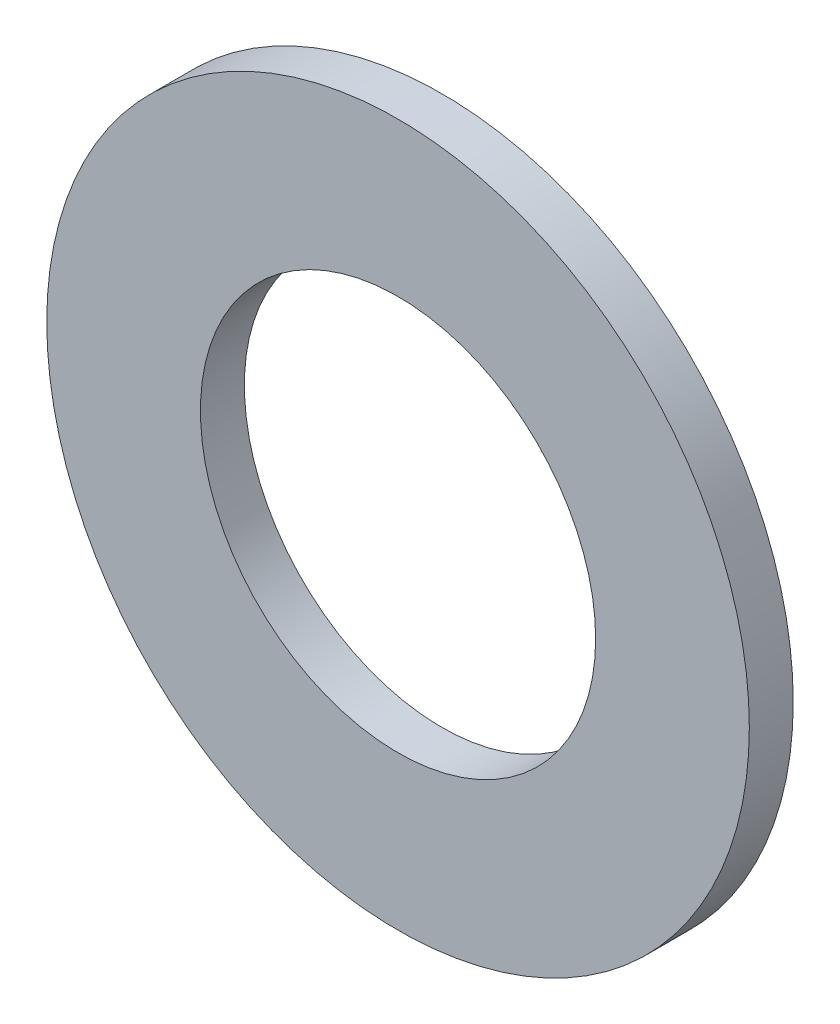
ISO-10303-21;
HEADER;
FILE_DESCRIPTION(('STEP AP214'),'2;1');
FILE_NAME('part.step','',(''),(''),'','','');
FILE_SCHEMA(('AUTOMOTIVE_DESIGN { 1 0 10303 214 1 1 1 1 }'));
ENDSEC;
DATA;
#1=APPLICATION_CONTEXT('core data for automotive mechanical design processes');
#2=APPLICATION_PROTOCOL_DEFINITION('international standard','automotive_design',2000,#1);
#3=PRODUCT_CONTEXT('',#1,'mechanical');
#4=PRODUCT('Part','Part','',(#3));
#5=PRODUCT_RELATED_PRODUCT_CATEGORY('part','',(#4));
#6=PRODUCT_DEFINITION_FORMATION('','',#4);
#7=PRODUCT_DEFINITION_CONTEXT('part definition',#1,'design');
#8=PRODUCT_DEFINITION('design','',#6,#7);
#9=PRODUCT_DEFINITION_SHAPE('','',#8);
#10=(LENGTH_UNIT() NAMED_UNIT(*) SI_UNIT(.MILLI.,.METRE.));
#11=(NAMED_UNIT(*) PLANE_ANGLE_UNIT() SI_UNIT($,.RADIAN.));
#12=(NAMED_UNIT(*) SI_UNIT($,.STERADIAN.) SOLID_ANGLE_UNIT());
#13=UNCERTAINTY_MEASURE_WITH_UNIT(LENGTH_MEASURE(1.E-05),#10,'distance_accuracy_value','');
#14=(GEOMETRIC_REPRESENTATION_CONTEXT(3) GLOBAL_UNCERTAINTY_ASSIGNED_CONTEXT((#13)) GLOBAL_UNIT_ASSIGNED_CONTEXT((#10,
#11,#12)) REPRESENTATION_CONTEXT('',''));
#15=CARTESIAN_POINT('',(0.,0.,0.));
#16=DIRECTION('',(0.,0.,1.));
#17=DIRECTION('',(1.,0.,0.));
#18=AXIS2_PLACEMENT_3D('',#15,#16,#17);
#19=CARTESIAN_POINT('',(0.,0.,-1.));
#20=DIRECTION('',(0.,0.,1.));
#21=DIRECTION('',(1.,0.,0.));
#22=AXIS2_PLACEMENT_3D('',#19,#20,#21);
#23=CYLINDRICAL_SURFACE('',#22,8.);
#24=CARTESIAN_POINT('',(0.,0.,-1.));
#25=DIRECTION('',(0.,0.,1.));
#26=DIRECTION('',(1.,0.,0.));
#27=AXIS2_PLACEMENT_3D('',#24,#25,#26);
#28=CIRCLE('',#27,8.);
#29=CARTESIAN_POINT('',(8.,0.,-1.));
#30=VERTEX_POINT('',#29);
#31=EDGE_CURVE('E10',#30,#30,#28,.T.);
#32=ORIENTED_EDGE('',*,*,#31,.T.);
#33=EDGE_LOOP('',(#32));
#34=FACE_BOUND('',#33,.T.);
#35=CARTESIAN_POINT('',(0.,0.,0.));
#36=DIRECTION('',(0.,0.,1.));
#37=DIRECTION('',(1.,0.,0.));
#38=AXIS2_PLACEMENT_3D('',#35,#36,#37);
#39=CIRCLE('',#38,8.);
#40=CARTESIAN_POINT('',(8.,0.,0.));
#41=VERTEX_POINT('',#40);
#42=EDGE_CURVE('E40',#41,#41,#39,.T.);
#43=ORIENTED_EDGE('',*,*,#42,.F.);
#44=EDGE_LOOP('',(#43));
#45=FACE_BOUND('',#44,.T.);
#46=ADVANCED_FACE('F37',(#34,#45),#23,.T.);
#47=CARTESIAN_POINT('',(0.,0.,-1.));
#48=DIRECTION('',(0.,0.,1.));
#49=DIRECTION('',(1.,0.,0.));
#50=AXIS2_PLACEMENT_3D('',#47,#48,#49);
#51=PLANE('',#50);
#52=CARTESIAN_POINT('',(0.,0.,-1.));
#53=DIRECTION('',(0.,0.,1.));
#54=DIRECTION('',(1.,0.,0.));
#55=AXIS2_PLACEMENT_3D('',#52,#53,#54);
#56=CIRCLE('',#55,4.5);
#57=CARTESIAN_POINT('',(4.5,0.,-1.));
#58=VERTEX_POINT('',#57);
#59=EDGE_CURVE('E47',#58,#58,#56,.T.);
#60=ORIENTED_EDGE('',*,*,#59,.T.);
#61=EDGE_LOOP('',(#60));
#62=FACE_BOUND('',#61,.T.);
#63=ORIENTED_EDGE('',*,*,#31,.F.);
#64=EDGE_LOOP('',(#63));
#65=FACE_BOUND('',#64,.T.);
#66=ADVANCED_FACE('F55',(#62,#65),#51,.F.);
#67=CARTESIAN_POINT('',(0.,0.,0.));
#68=DIRECTION('',(0.,0.,1.));
#69=DIRECTION('',(1.,0.,0.));
#70=AXIS2_PLACEMENT_3D('',#67,#68,#69);
#71=PLANE('',#70);
#72=CARTESIAN_POINT('',(0.,0.,0.));
#73=DIRECTION('',(0.,0.,1.));
#74=DIRECTION('',(1.,0.,0.));
#75=AXIS2_PLACEMENT_3D('',#72,#73,#74);
#76=CIRCLE('',#75,4.5);
#77=CARTESIAN_POINT('',(4.5,0.,0.));
#78=VERTEX_POINT('',#77);
#79=EDGE_CURVE('E49',#78,#78,#76,.T.);
#80=ORIENTED_EDGE('',*,*,#79,.F.);
#81=EDGE_LOOP('',(#80));
#82=FACE_BOUND('',#81,.T.);
#83=ORIENTED_EDGE('',*,*,#42,.T.);
#84=EDGE_LOOP('',(#83));
#85=FACE_BOUND('',#84,.T.);
#86=ADVANCED_FACE('F61',(#82,#85),#71,.T.);
#87=CARTESIAN_POINT('',(0.,0.,-1.));
#88=DIRECTION('',(0.,0.,1.));
#89=DIRECTION('',(1.,0.,0.));
#90=AXIS2_PLACEMENT_3D('',#87,#88,#89);
#91=CYLINDRICAL_SURFACE('',#90,4.5);
#92=ORIENTED_EDGE('',*,*,#59,.F.);
#93=EDGE_LOOP('',(#92));
#94=FACE_BOUND('',#93,.T.);
#95=ORIENTED_EDGE('',*,*,#79,.T.);
#96=EDGE_LOOP('',(#95));
#97=FACE_BOUND('',#96,.T.);
#98=ADVANCED_FACE('F58',(#94,#97),#91,.F.);
#99=CLOSED_SHELL('',(#46,#66,#86,#98));
#100=MANIFOLD_SOLID_BREP('B2',#99);
#101=ADVANCED_BREP_SHAPE_REPRESENTATION('',(#18,#100),#14);
#102=SHAPE_DEFINITION_REPRESENTATION(#9,#101);
ENDSEC;
END-ISO-10303-21;
